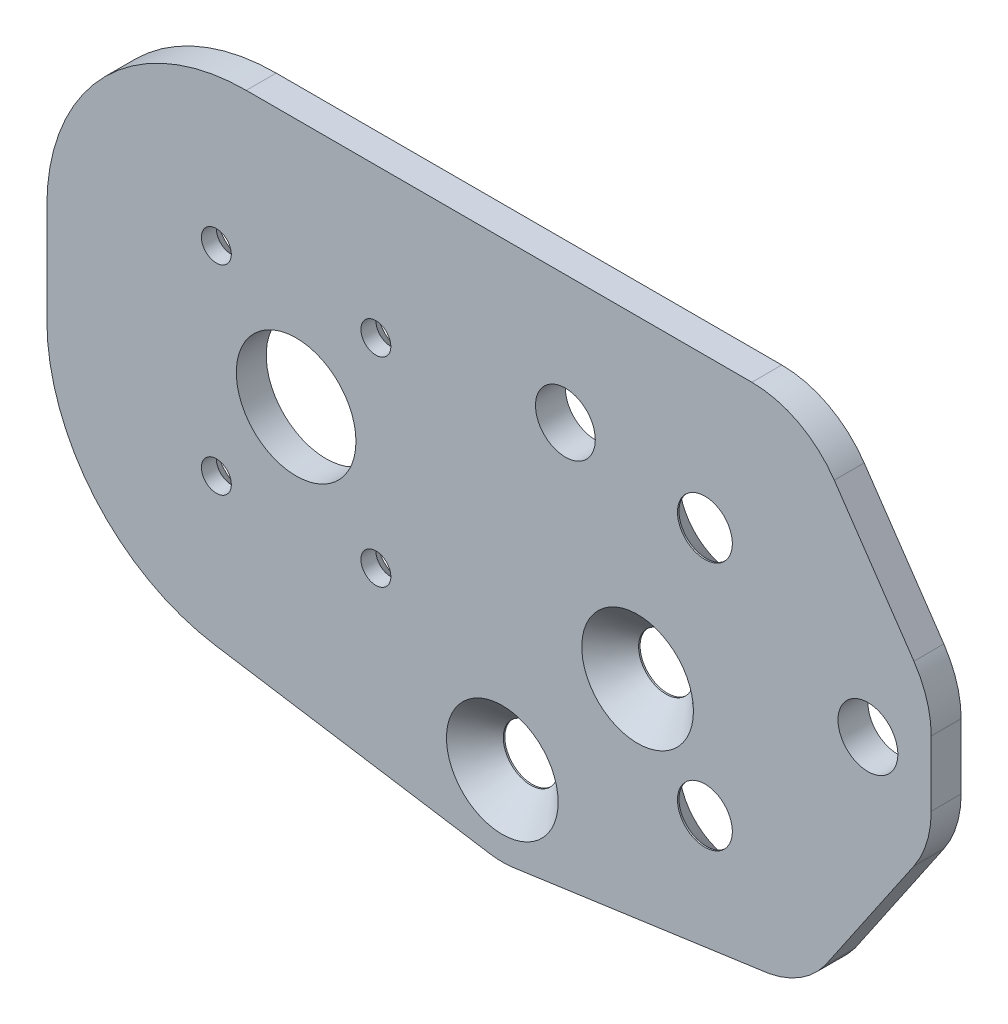
ISO-10303-21;
HEADER;
FILE_DESCRIPTION(('STEP AP214'),'2;1');
FILE_NAME('part.step','',(''),(''),'','','');
FILE_SCHEMA(('AUTOMOTIVE_DESIGN { 1 0 10303 214 1 1 1 1 }'));
ENDSEC;
DATA;
#1=APPLICATION_CONTEXT('core data for automotive mechanical design processes');
#2=APPLICATION_PROTOCOL_DEFINITION('international standard','automotive_design',2000,#1);
#3=PRODUCT_CONTEXT('',#1,'mechanical');
#4=PRODUCT('Part','Part','',(#3));
#5=PRODUCT_RELATED_PRODUCT_CATEGORY('part','',(#4));
#6=PRODUCT_DEFINITION_FORMATION('','',#4);
#7=PRODUCT_DEFINITION_CONTEXT('part definition',#1,'design');
#8=PRODUCT_DEFINITION('design','',#6,#7);
#9=PRODUCT_DEFINITION_SHAPE('','',#8);
#10=(LENGTH_UNIT() NAMED_UNIT(*) SI_UNIT(.MILLI.,.METRE.));
#11=(NAMED_UNIT(*) PLANE_ANGLE_UNIT() SI_UNIT($,.RADIAN.));
#12=(NAMED_UNIT(*) SI_UNIT($,.STERADIAN.) SOLID_ANGLE_UNIT());
#13=UNCERTAINTY_MEASURE_WITH_UNIT(LENGTH_MEASURE(1.E-05),#10,'distance_accuracy_value','');
#14=(GEOMETRIC_REPRESENTATION_CONTEXT(3) GLOBAL_UNCERTAINTY_ASSIGNED_CONTEXT((#13)) GLOBAL_UNIT_ASSIGNED_CONTEXT((#10,
#11,#12)) REPRESENTATION_CONTEXT('',''));
#15=CARTESIAN_POINT('',(0.,0.,0.));
#16=DIRECTION('',(0.,0.,1.));
#17=DIRECTION('',(1.,0.,0.));
#18=AXIS2_PLACEMENT_3D('',#15,#16,#17);
#19=CARTESIAN_POINT('',(0.,0.,3.));
#20=DIRECTION('',(0.,0.,-1.));
#21=DIRECTION('',(-1.,0.,0.));
#22=AXIS2_PLACEMENT_3D('',#19,#20,#21);
#23=PLANE('',#22);
#24=CARTESIAN_POINT('',(66.,35.,3.));
#25=DIRECTION('',(0.,0.,-1.));
#26=DIRECTION('',(-1.,0.,0.));
#27=AXIS2_PLACEMENT_3D('',#24,#25,#26);
#28=CIRCLE('',#27,2.74999999999999);
#29=CARTESIAN_POINT('',(63.25,35.,3.));
#30=VERTEX_POINT('',#29);
#31=EDGE_CURVE('E399',#30,#30,#28,.T.);
#32=ORIENTED_EDGE('',*,*,#31,.T.);
#33=EDGE_LOOP('',(#32));
#34=FACE_BOUND('',#33,.T.);
#35=CARTESIAN_POINT('',(66.,10.,3.));
#36=DIRECTION('',(0.,0.,-1.));
#37=DIRECTION('',(-1.,0.,0.));
#38=AXIS2_PLACEMENT_3D('',#35,#36,#37);
#39=CIRCLE('',#38,2.74999999999999);
#40=CARTESIAN_POINT('',(63.25,10.,3.));
#41=VERTEX_POINT('',#40);
#42=EDGE_CURVE('E390',#41,#41,#39,.T.);
#43=ORIENTED_EDGE('',*,*,#42,.T.);
#44=EDGE_LOOP('',(#43));
#45=FACE_BOUND('',#44,.T.);
#46=CARTESIAN_POINT('',(59.25,18.5,3.));
#47=DIRECTION('',(0.,0.,1.));
#48=DIRECTION('',(1.,0.,0.));
#49=AXIS2_PLACEMENT_3D('',#46,#47,#48);
#50=CIRCLE('',#49,5.6);
#51=CARTESIAN_POINT('',(64.85,18.5,3.));
#52=VERTEX_POINT('',#51);
#53=EDGE_CURVE('E387',#52,#52,#50,.T.);
#54=ORIENTED_EDGE('',*,*,#53,.F.);
#55=EDGE_LOOP('',(#54));
#56=FACE_BOUND('',#55,.T.);
#57=CARTESIAN_POINT('',(45.6807315621671,3.80731630837885,3.));
#58=DIRECTION('',(0.,0.,1.));
#59=DIRECTION('',(1.,0.,0.));
#60=AXIS2_PLACEMENT_3D('',#57,#58,#59);
#61=CIRCLE('',#60,5.6);
#62=CARTESIAN_POINT('',(51.2807315621671,3.80731630837885,3.));
#63=VERTEX_POINT('',#62);
#64=EDGE_CURVE('E378',#63,#63,#61,.T.);
#65=ORIENTED_EDGE('',*,*,#64,.F.);
#66=EDGE_LOOP('',(#65));
#67=FACE_BOUND('',#66,.T.);
#68=CARTESIAN_POINT('',(70.7403470261077,8.44715504380979,3.));
#69=DIRECTION('',(0.,0.,-1.));
#70=DIRECTION('',(-1.,0.,0.));
#71=AXIS2_PLACEMENT_3D('',#68,#69,#70);
#72=CIRCLE('',#71,9.10908448907365);
#73=CARTESIAN_POINT('',(78.0602989436961,3.02555711024113,3.));
#74=VERTEX_POINT('',#73);
#75=CARTESIAN_POINT('',(72.4471663459443,-0.500592607890878,3.));
#76=VERTEX_POINT('',#75);
#77=EDGE_CURVE('E144',#74,#76,#72,.T.);
#78=ORIENTED_EDGE('',*,*,#77,.F.);
#79=DIRECTION('',(-0.562855404948442,-0.826555378132842,0.));
#80=VECTOR('',#79,1.);
#81=CARTESIAN_POINT('',(51.9227282771398,-35.3575683174134,3.));
#82=LINE('',#81,#80);
#83=CARTESIAN_POINT('',(86.9655537813216,16.1029588993509,3.));
#84=VERTEX_POINT('',#83);
#85=EDGE_CURVE('E159',#84,#74,#82,.T.);
#86=ORIENTED_EDGE('',*,*,#85,.F.);
#87=CARTESIAN_POINT('',(78.6999999999932,21.7315129488353,3.));
#88=DIRECTION('',(0.,0.,-1.));
#89=DIRECTION('',(-1.,0.,0.));
#90=AXIS2_PLACEMENT_3D('',#87,#88,#89);
#91=CIRCLE('',#90,9.99999999999999);
#92=CARTESIAN_POINT('',(88.6999999999931,21.7315129488347,3.));
#93=VERTEX_POINT('',#92);
#94=EDGE_CURVE('E153',#93,#84,#91,.T.);
#95=ORIENTED_EDGE('',*,*,#94,.F.);
#96=DIRECTION('',(0.,-1.,0.));
#97=VECTOR('',#96,1.);
#98=CARTESIAN_POINT('',(88.6999999999919,-5.27260369399634E-12,3.));
#99=LINE('',#98,#97);
#100=CARTESIAN_POINT('',(88.6999999999935,28.2684870511611,3.));
#101=VERTEX_POINT('',#100);
#102=EDGE_CURVE('E183',#101,#93,#99,.T.);
#103=ORIENTED_EDGE('',*,*,#102,.F.);
#104=CARTESIAN_POINT('',(78.6999999999935,28.2684870511617,3.));
#105=DIRECTION('',(0.,0.,-1.));
#106=DIRECTION('',(-1.,0.,0.));
#107=AXIS2_PLACEMENT_3D('',#104,#105,#106);
#108=CIRCLE('',#107,10.);
#109=CARTESIAN_POINT('',(86.9655537813226,33.8970411006451,3.));
#110=VERTEX_POINT('',#109);
#111=EDGE_CURVE('E180',#110,#101,#108,.T.);
#112=ORIENTED_EDGE('',*,*,#111,.F.);
#113=DIRECTION('',(0.562855404948344,-0.826555378132909,0.));
#114=VECTOR('',#113,1.);
#115=CARTESIAN_POINT('',(75.1842863807105,51.1978786613888,3.));
#116=LINE('',#115,#114);
#117=CARTESIAN_POINT('',(78.9768023362709,45.6285540494824,3.));
#118=VERTEX_POINT('',#117);
#119=EDGE_CURVE('E171',#118,#110,#116,.T.);
#120=ORIENTED_EDGE('',*,*,#119,.F.);
#121=CARTESIAN_POINT('',(70.7112485549419,39.999999999999,3.));
#122=DIRECTION('',(0.,0.,-1.));
#123=DIRECTION('',(-1.,0.,0.));
#124=AXIS2_PLACEMENT_3D('',#121,#122,#123);
#125=CIRCLE('',#124,10.);
#126=CARTESIAN_POINT('',(70.7112485549419,50.,3.));
#127=VERTEX_POINT('',#126);
#128=EDGE_CURVE('E167',#127,#118,#125,.T.);
#129=ORIENTED_EDGE('',*,*,#128,.F.);
#130=DIRECTION('',(-1.,0.,0.));
#131=VECTOR('',#130,1.);
#132=CARTESIAN_POINT('',(0.,50.,3.));
#133=LINE('',#132,#131);
#134=CARTESIAN_POINT('',(20.,50.,3.));
#135=VERTEX_POINT('',#134);
#136=EDGE_CURVE('E63',#127,#135,#133,.T.);
#137=ORIENTED_EDGE('',*,*,#136,.T.);
#138=CARTESIAN_POINT('',(20.,30.,3.));
#139=DIRECTION('',(0.,0.,-1.));
#140=DIRECTION('',(-1.,0.,0.));
#141=AXIS2_PLACEMENT_3D('',#138,#139,#140);
#142=CIRCLE('',#141,20.);
#143=CARTESIAN_POINT('',(0.,30.,3.));
#144=VERTEX_POINT('',#143);
#145=EDGE_CURVE('E275',#135,#144,#142,.F.);
#146=ORIENTED_EDGE('',*,*,#145,.T.);
#147=DIRECTION('',(0.,-1.,0.));
#148=VECTOR('',#147,1.);
#149=CARTESIAN_POINT('',(0.,0.,3.));
#150=LINE('',#149,#148);
#151=CARTESIAN_POINT('',(0.,20.,3.));
#152=VERTEX_POINT('',#151);
#153=EDGE_CURVE('E257',#144,#152,#150,.T.);
#154=ORIENTED_EDGE('',*,*,#153,.T.);
#155=CARTESIAN_POINT('',(20.,20.,3.));
#156=DIRECTION('',(0.,0.,-1.));
#157=DIRECTION('',(-1.,0.,0.));
#158=AXIS2_PLACEMENT_3D('',#155,#156,#157);
#159=CIRCLE('',#158,20.);
#160=CARTESIAN_POINT('',(16.888140703302,0.243574925671539,3.));
#161=VERTEX_POINT('',#160);
#162=EDGE_CURVE('E277',#152,#161,#159,.F.);
#163=ORIENTED_EDGE('',*,*,#162,.T.);
#164=DIRECTION('',(-0.987821253716423,0.155592964834902,0.));
#165=VECTOR('',#164,1.);
#166=CARTESIAN_POINT('',(0.446284869277622,2.8333522634026,3.));
#167=LINE('',#166,#165);
#168=CARTESIAN_POINT('',(44.4359467579836,-4.0955145630582,3.));
#169=VERTEX_POINT('',#168);
#170=EDGE_CURVE('E219',#169,#161,#167,.T.);
#171=ORIENTED_EDGE('',*,*,#170,.F.);
#172=CARTESIAN_POINT('',(45.6807315621671,3.80731630837885,3.));
#173=DIRECTION('',(0.,0.,-1.));
#174=DIRECTION('',(-1.,0.,0.));
#175=AXIS2_PLACEMENT_3D('',#172,#173,#174);
#176=CIRCLE('',#175,8.00026405759614);
#177=CARTESIAN_POINT('',(46.7969396353484,-4.11469761035605,3.));
#178=VERTEX_POINT('',#177);
#179=EDGE_CURVE('E216',#178,#169,#176,.T.);
#180=ORIENTED_EDGE('',*,*,#179,.F.);
#181=DIRECTION('',(-0.990219055483932,-0.13952140393685,0.));
#182=VECTOR('',#181,1.);
#183=CARTESIAN_POINT('',(1.47943288389472,-10.4999132147866,3.));
#184=LINE('',#183,#182);
#185=EDGE_CURVE('E162',#76,#178,#184,.T.);
#186=ORIENTED_EDGE('',*,*,#185,.F.);
#187=EDGE_LOOP('',(#78,#86,#95,#103,#112,#120,#129,#137,#146,#154,#163,#171,#180,#186));
#188=FACE_BOUND('',#187,.T.);
#189=CARTESIAN_POINT('',(52.0071048996352,37.1424373558049,3.));
#190=DIRECTION('',(0.,0.,1.));
#191=DIRECTION('',(1.,0.,0.));
#192=AXIS2_PLACEMENT_3D('',#189,#190,#191);
#193=CIRCLE('',#192,3.);
#194=CARTESIAN_POINT('',(55.0071048996352,37.1424373558049,3.));
#195=VERTEX_POINT('',#194);
#196=EDGE_CURVE('E228',#195,#195,#193,.T.);
#197=ORIENTED_EDGE('',*,*,#196,.F.);
#198=EDGE_LOOP('',(#197));
#199=FACE_BOUND('',#198,.T.);
#200=CARTESIAN_POINT('',(17.,35.,3.));
#201=DIRECTION('',(0.,0.,1.));
#202=DIRECTION('',(1.,0.,0.));
#203=AXIS2_PLACEMENT_3D('',#200,#201,#202);
#204=CIRCLE('',#203,1.5);
#205=CARTESIAN_POINT('',(18.5,35.,3.));
#206=VERTEX_POINT('',#205);
#207=EDGE_CURVE('E236',#206,#206,#204,.T.);
#208=ORIENTED_EDGE('',*,*,#207,.F.);
#209=EDGE_LOOP('',(#208));
#210=FACE_BOUND('',#209,.T.);
#211=CARTESIAN_POINT('',(17.,15.,3.));
#212=DIRECTION('',(0.,0.,1.));
#213=DIRECTION('',(1.,0.,0.));
#214=AXIS2_PLACEMENT_3D('',#211,#212,#213);
#215=CIRCLE('',#214,1.5);
#216=CARTESIAN_POINT('',(18.5,15.,3.));
#217=VERTEX_POINT('',#216);
#218=EDGE_CURVE('E243',#217,#217,#215,.T.);
#219=ORIENTED_EDGE('',*,*,#218,.F.);
#220=EDGE_LOOP('',(#219));
#221=FACE_BOUND('',#220,.T.);
#222=CARTESIAN_POINT('',(33.,15.,3.));
#223=DIRECTION('',(0.,0.,1.));
#224=DIRECTION('',(1.,0.,0.));
#225=AXIS2_PLACEMENT_3D('',#222,#223,#224);
#226=CIRCLE('',#225,1.5);
#227=CARTESIAN_POINT('',(34.5,15.,3.));
#228=VERTEX_POINT('',#227);
#229=EDGE_CURVE('E239',#228,#228,#226,.T.);
#230=ORIENTED_EDGE('',*,*,#229,.F.);
#231=EDGE_LOOP('',(#230));
#232=FACE_BOUND('',#231,.T.);
#233=CARTESIAN_POINT('',(33.,35.,3.));
#234=DIRECTION('',(0.,0.,1.));
#235=DIRECTION('',(1.,0.,0.));
#236=AXIS2_PLACEMENT_3D('',#233,#234,#235);
#237=CIRCLE('',#236,1.5);
#238=CARTESIAN_POINT('',(34.5,35.,3.));
#239=VERTEX_POINT('',#238);
#240=EDGE_CURVE('E242',#239,#239,#237,.T.);
#241=ORIENTED_EDGE('',*,*,#240,.F.);
#242=EDGE_LOOP('',(#241));
#243=FACE_BOUND('',#242,.T.);
#244=CARTESIAN_POINT('',(25.,25.,3.));
#245=DIRECTION('',(0.,0.,1.));
#246=DIRECTION('',(1.,0.,0.));
#247=AXIS2_PLACEMENT_3D('',#244,#245,#246);
#248=CIRCLE('',#247,6.);
#249=CARTESIAN_POINT('',(31.,25.,3.));
#250=VERTEX_POINT('',#249);
#251=EDGE_CURVE('E251',#250,#250,#248,.T.);
#252=ORIENTED_EDGE('',*,*,#251,.F.);
#253=EDGE_LOOP('',(#252));
#254=FACE_BOUND('',#253,.T.);
#255=CARTESIAN_POINT('',(82.3499999999919,25.0000000000032,3.));
#256=DIRECTION('',(0.,0.,-1.));
#257=DIRECTION('',(-1.,0.,0.));
#258=AXIS2_PLACEMENT_3D('',#255,#256,#257);
#259=CIRCLE('',#258,3.00000000000001);
#260=CARTESIAN_POINT('',(79.3499999999919,25.0000000000032,3.));
#261=VERTEX_POINT('',#260);
#262=EDGE_CURVE('E168',#261,#261,#259,.T.);
#263=ORIENTED_EDGE('',*,*,#262,.T.);
#264=EDGE_LOOP('',(#263));
#265=FACE_BOUND('',#264,.T.);
#266=ADVANCED_FACE('F39',(#34,#45,#56,#67,#188,#199,#210,#221,#232,#243,#254,#265),#23,.F.);
#267=CARTESIAN_POINT('',(0.,0.,0.));
#268=DIRECTION('',(0.,0.,-1.));
#269=DIRECTION('',(-1.,0.,0.));
#270=AXIS2_PLACEMENT_3D('',#267,#268,#269);
#271=PLANE('',#270);
#272=CARTESIAN_POINT('',(66.,35.,0.));
#273=DIRECTION('',(0.,0.,-1.));
#274=DIRECTION('',(-1.,0.,0.));
#275=AXIS2_PLACEMENT_3D('',#272,#273,#274);
#276=CIRCLE('',#275,5.59999999999999);
#277=CARTESIAN_POINT('',(60.4,35.,0.));
#278=VERTEX_POINT('',#277);
#279=EDGE_CURVE('E405',#278,#278,#276,.T.);
#280=ORIENTED_EDGE('',*,*,#279,.F.);
#281=EDGE_LOOP('',(#280));
#282=FACE_BOUND('',#281,.T.);
#283=CARTESIAN_POINT('',(66.,10.,0.));
#284=DIRECTION('',(0.,0.,-1.));
#285=DIRECTION('',(-1.,0.,0.));
#286=AXIS2_PLACEMENT_3D('',#283,#284,#285);
#287=CIRCLE('',#286,5.59999999999999);
#288=CARTESIAN_POINT('',(60.4,10.,0.));
#289=VERTEX_POINT('',#288);
#290=EDGE_CURVE('E396',#289,#289,#287,.T.);
#291=ORIENTED_EDGE('',*,*,#290,.F.);
#292=EDGE_LOOP('',(#291));
#293=FACE_BOUND('',#292,.T.);
#294=CARTESIAN_POINT('',(59.25,18.5,0.));
#295=DIRECTION('',(0.,0.,1.));
#296=DIRECTION('',(1.,0.,0.));
#297=AXIS2_PLACEMENT_3D('',#294,#295,#296);
#298=CIRCLE('',#297,2.75);
#299=CARTESIAN_POINT('',(62.,18.5,0.));
#300=VERTEX_POINT('',#299);
#301=EDGE_CURVE('E381',#300,#300,#298,.T.);
#302=ORIENTED_EDGE('',*,*,#301,.T.);
#303=EDGE_LOOP('',(#302));
#304=FACE_BOUND('',#303,.T.);
#305=CARTESIAN_POINT('',(45.6807315621671,3.80731630837885,0.));
#306=DIRECTION('',(0.,0.,1.));
#307=DIRECTION('',(1.,0.,0.));
#308=AXIS2_PLACEMENT_3D('',#305,#306,#307);
#309=CIRCLE('',#308,2.75);
#310=CARTESIAN_POINT('',(48.430731562167,3.80731630837885,0.));
#311=VERTEX_POINT('',#310);
#312=EDGE_CURVE('E346',#311,#311,#309,.T.);
#313=ORIENTED_EDGE('',*,*,#312,.T.);
#314=EDGE_LOOP('',(#313));
#315=FACE_BOUND('',#314,.T.);
#316=CARTESIAN_POINT('',(17.,35.,0.));
#317=DIRECTION('',(0.,0.,-1.));
#318=DIRECTION('',(-1.,0.,0.));
#319=AXIS2_PLACEMENT_3D('',#316,#317,#318);
#320=CIRCLE('',#319,3.);
#321=CARTESIAN_POINT('',(14.,35.,0.));
#322=VERTEX_POINT('',#321);
#323=EDGE_CURVE('E291',#322,#322,#320,.F.);
#324=ORIENTED_EDGE('',*,*,#323,.T.);
#325=EDGE_LOOP('',(#324));
#326=FACE_BOUND('',#325,.T.);
#327=CARTESIAN_POINT('',(17.,15.,0.));
#328=DIRECTION('',(0.,0.,-1.));
#329=DIRECTION('',(-1.,0.,0.));
#330=AXIS2_PLACEMENT_3D('',#327,#328,#329);
#331=CIRCLE('',#330,3.);
#332=CARTESIAN_POINT('',(14.,15.,0.));
#333=VERTEX_POINT('',#332);
#334=EDGE_CURVE('E288',#333,#333,#331,.F.);
#335=ORIENTED_EDGE('',*,*,#334,.T.);
#336=EDGE_LOOP('',(#335));
#337=FACE_BOUND('',#336,.T.);
#338=CARTESIAN_POINT('',(33.,15.,0.));
#339=DIRECTION('',(0.,0.,-1.));
#340=DIRECTION('',(-1.,0.,0.));
#341=AXIS2_PLACEMENT_3D('',#338,#339,#340);
#342=CIRCLE('',#341,3.);
#343=CARTESIAN_POINT('',(30.,15.,0.));
#344=VERTEX_POINT('',#343);
#345=EDGE_CURVE('E285',#344,#344,#342,.F.);
#346=ORIENTED_EDGE('',*,*,#345,.T.);
#347=EDGE_LOOP('',(#346));
#348=FACE_BOUND('',#347,.T.);
#349=CARTESIAN_POINT('',(33.,35.,0.));
#350=DIRECTION('',(0.,0.,-1.));
#351=DIRECTION('',(-1.,0.,0.));
#352=AXIS2_PLACEMENT_3D('',#349,#350,#351);
#353=CIRCLE('',#352,3.);
#354=CARTESIAN_POINT('',(30.,35.,0.));
#355=VERTEX_POINT('',#354);
#356=EDGE_CURVE('E282',#355,#355,#353,.F.);
#357=ORIENTED_EDGE('',*,*,#356,.T.);
#358=EDGE_LOOP('',(#357));
#359=FACE_BOUND('',#358,.T.);
#360=CARTESIAN_POINT('',(82.3499999999919,25.0000000000032,0.));
#361=DIRECTION('',(0.,0.,-1.));
#362=DIRECTION('',(-1.,0.,0.));
#363=AXIS2_PLACEMENT_3D('',#360,#361,#362);
#364=CIRCLE('',#363,3.00000000000001);
#365=CARTESIAN_POINT('',(79.3499999999919,25.0000000000032,0.));
#366=VERTEX_POINT('',#365);
#367=EDGE_CURVE('E187',#366,#366,#364,.T.);
#368=ORIENTED_EDGE('',*,*,#367,.F.);
#369=EDGE_LOOP('',(#368));
#370=FACE_BOUND('',#369,.T.);
#371=CARTESIAN_POINT('',(25.,25.,0.));
#372=DIRECTION('',(0.,0.,1.));
#373=DIRECTION('',(1.,0.,0.));
#374=AXIS2_PLACEMENT_3D('',#371,#372,#373);
#375=CIRCLE('',#374,6.);
#376=CARTESIAN_POINT('',(31.,25.,0.));
#377=VERTEX_POINT('',#376);
#378=EDGE_CURVE('E250',#377,#377,#375,.T.);
#379=ORIENTED_EDGE('',*,*,#378,.T.);
#380=EDGE_LOOP('',(#379));
#381=FACE_BOUND('',#380,.T.);
#382=CARTESIAN_POINT('',(52.0071048996352,37.1424373558049,0.));
#383=DIRECTION('',(0.,0.,1.));
#384=DIRECTION('',(1.,0.,0.));
#385=AXIS2_PLACEMENT_3D('',#382,#383,#384);
#386=CIRCLE('',#385,3.);
#387=CARTESIAN_POINT('',(55.0071048996352,37.1424373558049,0.));
#388=VERTEX_POINT('',#387);
#389=EDGE_CURVE('E233',#388,#388,#386,.T.);
#390=ORIENTED_EDGE('',*,*,#389,.T.);
#391=EDGE_LOOP('',(#390));
#392=FACE_BOUND('',#391,.T.);
#393=DIRECTION('',(-0.562855404948442,-0.826555378132842,0.));
#394=VECTOR('',#393,1.);
#395=CARTESIAN_POINT('',(51.9227282771398,-35.3575683174134,0.));
#396=LINE('',#395,#394);
#397=CARTESIAN_POINT('',(86.9655537813216,16.1029588993509,0.));
#398=VERTEX_POINT('',#397);
#399=CARTESIAN_POINT('',(78.0602989436961,3.02555711024113,0.));
#400=VERTEX_POINT('',#399);
#401=EDGE_CURVE('E190',#398,#400,#396,.T.);
#402=ORIENTED_EDGE('',*,*,#401,.T.);
#403=CARTESIAN_POINT('',(70.7403470261077,8.44715504380979,0.));
#404=DIRECTION('',(0.,0.,-1.));
#405=DIRECTION('',(-1.,0.,0.));
#406=AXIS2_PLACEMENT_3D('',#403,#404,#405);
#407=CIRCLE('',#406,9.10908448907365);
#408=CARTESIAN_POINT('',(72.4471663459443,-0.500592607890878,0.));
#409=VERTEX_POINT('',#408);
#410=EDGE_CURVE('E147',#400,#409,#407,.T.);
#411=ORIENTED_EDGE('',*,*,#410,.T.);
#412=DIRECTION('',(-0.990219055483932,-0.13952140393685,0.));
#413=VECTOR('',#412,1.);
#414=CARTESIAN_POINT('',(1.47943288389472,-10.4999132147866,0.));
#415=LINE('',#414,#413);
#416=CARTESIAN_POINT('',(46.7969396353484,-4.11469761035605,0.));
#417=VERTEX_POINT('',#416);
#418=EDGE_CURVE('E207',#409,#417,#415,.T.);
#419=ORIENTED_EDGE('',*,*,#418,.T.);
#420=CARTESIAN_POINT('',(45.6807315621671,3.80731630837885,0.));
#421=DIRECTION('',(0.,0.,-1.));
#422=DIRECTION('',(-1.,0.,0.));
#423=AXIS2_PLACEMENT_3D('',#420,#421,#422);
#424=CIRCLE('',#423,8.00026405759614);
#425=CARTESIAN_POINT('',(44.4359467579836,-4.0955145630582,0.));
#426=VERTEX_POINT('',#425);
#427=EDGE_CURVE('E223',#417,#426,#424,.T.);
#428=ORIENTED_EDGE('',*,*,#427,.T.);
#429=DIRECTION('',(-0.987821253716423,0.155592964834902,0.));
#430=VECTOR('',#429,1.);
#431=CARTESIAN_POINT('',(0.446284869277622,2.8333522634026,0.));
#432=LINE('',#431,#430);
#433=CARTESIAN_POINT('',(16.888140703302,0.243574925671546,0.));
#434=VERTEX_POINT('',#433);
#435=EDGE_CURVE('E55',#426,#434,#432,.T.);
#436=ORIENTED_EDGE('',*,*,#435,.T.);
#437=CARTESIAN_POINT('',(20.,20.,0.));
#438=DIRECTION('',(0.,0.,-1.));
#439=DIRECTION('',(-1.,0.,0.));
#440=AXIS2_PLACEMENT_3D('',#437,#438,#439);
#441=CIRCLE('',#440,20.);
#442=CARTESIAN_POINT('',(0.,20.,0.));
#443=VERTEX_POINT('',#442);
#444=EDGE_CURVE('E268',#434,#443,#441,.T.);
#445=ORIENTED_EDGE('',*,*,#444,.T.);
#446=DIRECTION('',(0.,-1.,0.));
#447=VECTOR('',#446,1.);
#448=CARTESIAN_POINT('',(0.,0.,0.));
#449=LINE('',#448,#447);
#450=CARTESIAN_POINT('',(0.,30.,0.));
#451=VERTEX_POINT('',#450);
#452=EDGE_CURVE('E254',#451,#443,#449,.T.);
#453=ORIENTED_EDGE('',*,*,#452,.F.);
#454=CARTESIAN_POINT('',(20.,30.,0.));
#455=DIRECTION('',(0.,0.,-1.));
#456=DIRECTION('',(-1.,0.,0.));
#457=AXIS2_PLACEMENT_3D('',#454,#455,#456);
#458=CIRCLE('',#457,20.);
#459=CARTESIAN_POINT('',(20.,50.,0.));
#460=VERTEX_POINT('',#459);
#461=EDGE_CURVE('E262',#451,#460,#458,.T.);
#462=ORIENTED_EDGE('',*,*,#461,.T.);
#463=DIRECTION('',(-1.,0.,0.));
#464=VECTOR('',#463,1.);
#465=CARTESIAN_POINT('',(0.,50.,0.));
#466=LINE('',#465,#464);
#467=CARTESIAN_POINT('',(70.7112485549419,50.,0.));
#468=VERTEX_POINT('',#467);
#469=EDGE_CURVE('E260',#468,#460,#466,.T.);
#470=ORIENTED_EDGE('',*,*,#469,.F.);
#471=CARTESIAN_POINT('',(70.7112485549419,39.999999999999,0.));
#472=DIRECTION('',(0.,0.,-1.));
#473=DIRECTION('',(-1.,0.,0.));
#474=AXIS2_PLACEMENT_3D('',#471,#472,#473);
#475=CIRCLE('',#474,10.);
#476=CARTESIAN_POINT('',(78.9768023362709,45.6285540494824,0.));
#477=VERTEX_POINT('',#476);
#478=EDGE_CURVE('E192',#468,#477,#475,.T.);
#479=ORIENTED_EDGE('',*,*,#478,.T.);
#480=DIRECTION('',(0.562855404948344,-0.826555378132909,0.));
#481=VECTOR('',#480,1.);
#482=CARTESIAN_POINT('',(75.1842863807105,51.1978786613888,0.));
#483=LINE('',#482,#481);
#484=CARTESIAN_POINT('',(86.9655537813226,33.8970411006451,0.));
#485=VERTEX_POINT('',#484);
#486=EDGE_CURVE('E195',#477,#485,#483,.T.);
#487=ORIENTED_EDGE('',*,*,#486,.T.);
#488=CARTESIAN_POINT('',(78.6999999999935,28.2684870511617,0.));
#489=DIRECTION('',(0.,0.,-1.));
#490=DIRECTION('',(-1.,0.,0.));
#491=AXIS2_PLACEMENT_3D('',#488,#489,#490);
#492=CIRCLE('',#491,10.);
#493=CARTESIAN_POINT('',(88.6999999999935,28.2684870511611,0.));
#494=VERTEX_POINT('',#493);
#495=EDGE_CURVE('E198',#485,#494,#492,.T.);
#496=ORIENTED_EDGE('',*,*,#495,.T.);
#497=DIRECTION('',(0.,-1.,0.));
#498=VECTOR('',#497,1.);
#499=CARTESIAN_POINT('',(88.6999999999919,-5.27260369399634E-12,0.));
#500=LINE('',#499,#498);
#501=CARTESIAN_POINT('',(88.6999999999931,21.7315129488347,0.));
#502=VERTEX_POINT('',#501);
#503=EDGE_CURVE('E201',#494,#502,#500,.T.);
#504=ORIENTED_EDGE('',*,*,#503,.T.);
#505=CARTESIAN_POINT('',(78.6999999999932,21.7315129488353,0.));
#506=DIRECTION('',(0.,0.,-1.));
#507=DIRECTION('',(-1.,0.,0.));
#508=AXIS2_PLACEMENT_3D('',#505,#506,#507);
#509=CIRCLE('',#508,9.99999999999999);
#510=EDGE_CURVE('E174',#502,#398,#509,.T.);
#511=ORIENTED_EDGE('',*,*,#510,.T.);
#512=EDGE_LOOP('',(#402,#411,#419,#428,#436,#445,#453,#462,#470,#479,#487,#496,#504,#511));
#513=FACE_BOUND('',#512,.T.);
#514=ADVANCED_FACE('F311',(#282,#293,#304,#315,#326,#337,#348,#359,#370,#381,#392,#513),#271,.T.);
#515=CARTESIAN_POINT('',(0.,50.,3.));
#516=DIRECTION('',(0.,-1.,0.));
#517=DIRECTION('',(0.,0.,-1.));
#518=AXIS2_PLACEMENT_3D('',#515,#516,#517);
#519=PLANE('',#518);
#520=DIRECTION('',(0.,0.,-1.));
#521=VECTOR('',#520,1.);
#522=CARTESIAN_POINT('',(70.7112485549419,50.,3.));
#523=LINE('',#522,#521);
#524=EDGE_CURVE('E343',#127,#468,#523,.T.);
#525=ORIENTED_EDGE('',*,*,#524,.T.);
#526=ORIENTED_EDGE('',*,*,#469,.T.);
#527=DIRECTION('',(0.,0.,-1.));
#528=VECTOR('',#527,1.);
#529=CARTESIAN_POINT('',(20.,50.,3.));
#530=LINE('',#529,#528);
#531=EDGE_CURVE('E280',#460,#135,#530,.F.);
#532=ORIENTED_EDGE('',*,*,#531,.T.);
#533=ORIENTED_EDGE('',*,*,#136,.F.);
#534=EDGE_LOOP('',(#525,#526,#532,#533));
#535=FACE_BOUND('',#534,.T.);
#536=ADVANCED_FACE('F314',(#535),#519,.F.);
#537=CARTESIAN_POINT('',(1.47943288389472,-10.4999132147866,3.));
#538=DIRECTION('',(0.139521403936849,-0.990219055483932,0.));
#539=DIRECTION('',(0.990219055483932,0.13952140393685,0.));
#540=AXIS2_PLACEMENT_3D('',#537,#538,#539);
#541=PLANE('',#540);
#542=ORIENTED_EDGE('',*,*,#418,.F.);
#543=DIRECTION('',(0.,0.,-1.));
#544=VECTOR('',#543,1.);
#545=CARTESIAN_POINT('',(72.4471663459443,-0.500592607890878,3.));
#546=LINE('',#545,#544);
#547=EDGE_CURVE('E163',#76,#409,#546,.T.);
#548=ORIENTED_EDGE('',*,*,#547,.F.);
#549=ORIENTED_EDGE('',*,*,#185,.T.);
#550=DIRECTION('',(0.,0.,-1.));
#551=VECTOR('',#550,1.);
#552=CARTESIAN_POINT('',(46.7969396353484,-4.11469761035605,3.));
#553=LINE('',#552,#551);
#554=EDGE_CURVE('E221',#178,#417,#553,.T.);
#555=ORIENTED_EDGE('',*,*,#554,.T.);
#556=EDGE_LOOP('',(#542,#548,#549,#555));
#557=FACE_BOUND('',#556,.T.);
#558=ADVANCED_FACE('F369',(#557),#541,.T.);
#559=CARTESIAN_POINT('',(20.,20.,3.));
#560=DIRECTION('',(0.,0.,-1.));
#561=DIRECTION('',(-1.,0.,0.));
#562=AXIS2_PLACEMENT_3D('',#559,#560,#561);
#563=CYLINDRICAL_SURFACE('',#562,20.);
#564=ORIENTED_EDGE('',*,*,#444,.F.);
#565=DIRECTION('',(0.,0.,-1.));
#566=VECTOR('',#565,1.);
#567=CARTESIAN_POINT('',(16.888140703302,0.243574925671539,3.));
#568=LINE('',#567,#566);
#569=EDGE_CURVE('E226',#161,#434,#568,.T.);
#570=ORIENTED_EDGE('',*,*,#569,.F.);
#571=ORIENTED_EDGE('',*,*,#162,.F.);
#572=DIRECTION('',(0.,0.,-1.));
#573=VECTOR('',#572,1.);
#574=CARTESIAN_POINT('',(0.,20.,3.));
#575=LINE('',#574,#573);
#576=EDGE_CURVE('E273',#443,#152,#575,.F.);
#577=ORIENTED_EDGE('',*,*,#576,.F.);
#578=EDGE_LOOP('',(#564,#570,#571,#577));
#579=FACE_BOUND('',#578,.T.);
#580=ADVANCED_FACE('F360',(#579),#563,.T.);
#581=CARTESIAN_POINT('',(0.,0.,3.));
#582=DIRECTION('',(1.,0.,0.));
#583=DIRECTION('',(0.,0.,-1.));
#584=AXIS2_PLACEMENT_3D('',#581,#582,#583);
#585=PLANE('',#584);
#586=ORIENTED_EDGE('',*,*,#452,.T.);
#587=ORIENTED_EDGE('',*,*,#576,.T.);
#588=ORIENTED_EDGE('',*,*,#153,.F.);
#589=DIRECTION('',(0.,0.,-1.));
#590=VECTOR('',#589,1.);
#591=CARTESIAN_POINT('',(0.,30.,3.));
#592=LINE('',#591,#590);
#593=EDGE_CURVE('E270',#144,#451,#592,.T.);
#594=ORIENTED_EDGE('',*,*,#593,.T.);
#595=EDGE_LOOP('',(#586,#587,#588,#594));
#596=FACE_BOUND('',#595,.T.);
#597=ADVANCED_FACE('F355',(#596),#585,.F.);
#598=CARTESIAN_POINT('',(25.,25.,3.));
#599=DIRECTION('',(0.,0.,-1.));
#600=DIRECTION('',(-1.,0.,0.));
#601=AXIS2_PLACEMENT_3D('',#598,#599,#600);
#602=CYLINDRICAL_SURFACE('',#601,6.);
#603=ORIENTED_EDGE('',*,*,#251,.T.);
#604=EDGE_LOOP('',(#603));
#605=FACE_BOUND('',#604,.T.);
#606=ORIENTED_EDGE('',*,*,#378,.F.);
#607=EDGE_LOOP('',(#606));
#608=FACE_BOUND('',#607,.T.);
#609=ADVANCED_FACE('F439',(#605,#608),#602,.F.);
#610=CARTESIAN_POINT('',(20.,30.,3.));
#611=DIRECTION('',(0.,0.,-1.));
#612=DIRECTION('',(-1.,0.,0.));
#613=AXIS2_PLACEMENT_3D('',#610,#611,#612);
#614=CYLINDRICAL_SURFACE('',#613,20.);
#615=ORIENTED_EDGE('',*,*,#145,.F.);
#616=ORIENTED_EDGE('',*,*,#531,.F.);
#617=ORIENTED_EDGE('',*,*,#461,.F.);
#618=ORIENTED_EDGE('',*,*,#593,.F.);
#619=EDGE_LOOP('',(#615,#616,#617,#618));
#620=FACE_BOUND('',#619,.T.);
#621=ADVANCED_FACE('F351',(#620),#614,.T.);
#622=CARTESIAN_POINT('',(33.,35.,0.));
#623=DIRECTION('',(0.,0.,1.));
#624=DIRECTION('',(1.,0.,0.));
#625=AXIS2_PLACEMENT_3D('',#622,#623,#624);
#626=CYLINDRICAL_SURFACE('',#625,1.5);
#627=CARTESIAN_POINT('',(33.,35.,1.5));
#628=DIRECTION('',(0.,0.,-1.));
#629=DIRECTION('',(-1.,0.,0.));
#630=AXIS2_PLACEMENT_3D('',#627,#628,#629);
#631=CIRCLE('',#630,1.5);
#632=CARTESIAN_POINT('',(31.5,35.,1.5));
#633=VERTEX_POINT('',#632);
#634=EDGE_CURVE('E11',#633,#633,#631,.T.);
#635=ORIENTED_EDGE('',*,*,#634,.T.);
#636=EDGE_LOOP('',(#635));
#637=FACE_BOUND('',#636,.T.);
#638=ORIENTED_EDGE('',*,*,#240,.T.);
#639=EDGE_LOOP('',(#638));
#640=FACE_BOUND('',#639,.T.);
#641=ADVANCED_FACE('F449',(#637,#640),#626,.F.);
#642=CARTESIAN_POINT('',(33.,15.,0.));
#643=DIRECTION('',(0.,0.,1.));
#644=DIRECTION('',(1.,0.,0.));
#645=AXIS2_PLACEMENT_3D('',#642,#643,#644);
#646=CYLINDRICAL_SURFACE('',#645,1.5);
#647=CARTESIAN_POINT('',(33.,15.,1.5));
#648=DIRECTION('',(0.,0.,-1.));
#649=DIRECTION('',(-1.,0.,0.));
#650=AXIS2_PLACEMENT_3D('',#647,#648,#649);
#651=CIRCLE('',#650,1.5);
#652=CARTESIAN_POINT('',(31.5,15.,1.5));
#653=VERTEX_POINT('',#652);
#654=EDGE_CURVE('E48',#653,#653,#651,.T.);
#655=ORIENTED_EDGE('',*,*,#654,.T.);
#656=EDGE_LOOP('',(#655));
#657=FACE_BOUND('',#656,.T.);
#658=ORIENTED_EDGE('',*,*,#229,.T.);
#659=EDGE_LOOP('',(#658));
#660=FACE_BOUND('',#659,.T.);
#661=ADVANCED_FACE('F302',(#657,#660),#646,.F.);
#662=CARTESIAN_POINT('',(17.,15.,0.));
#663=DIRECTION('',(0.,0.,1.));
#664=DIRECTION('',(1.,0.,0.));
#665=AXIS2_PLACEMENT_3D('',#662,#663,#664);
#666=CYLINDRICAL_SURFACE('',#665,1.5);
#667=CARTESIAN_POINT('',(17.,15.,1.50000000000001));
#668=DIRECTION('',(0.,0.,-1.));
#669=DIRECTION('',(-1.,0.,0.));
#670=AXIS2_PLACEMENT_3D('',#667,#668,#669);
#671=CIRCLE('',#670,1.5);
#672=CARTESIAN_POINT('',(15.5,15.,1.50000000000001));
#673=VERTEX_POINT('',#672);
#674=EDGE_CURVE('E297',#673,#673,#671,.T.);
#675=ORIENTED_EDGE('',*,*,#674,.T.);
#676=EDGE_LOOP('',(#675));
#677=FACE_BOUND('',#676,.T.);
#678=ORIENTED_EDGE('',*,*,#218,.T.);
#679=EDGE_LOOP('',(#678));
#680=FACE_BOUND('',#679,.T.);
#681=ADVANCED_FACE('F500',(#677,#680),#666,.F.);
#682=CARTESIAN_POINT('',(17.,35.,0.));
#683=DIRECTION('',(0.,0.,1.));
#684=DIRECTION('',(1.,0.,0.));
#685=AXIS2_PLACEMENT_3D('',#682,#683,#684);
#686=CYLINDRICAL_SURFACE('',#685,1.5);
#687=CARTESIAN_POINT('',(17.,35.,1.50000000000001));
#688=DIRECTION('',(0.,0.,-1.));
#689=DIRECTION('',(-1.,0.,0.));
#690=AXIS2_PLACEMENT_3D('',#687,#688,#689);
#691=CIRCLE('',#690,1.5);
#692=CARTESIAN_POINT('',(15.5,35.,1.50000000000001));
#693=VERTEX_POINT('',#692);
#694=EDGE_CURVE('E294',#693,#693,#691,.T.);
#695=ORIENTED_EDGE('',*,*,#694,.T.);
#696=EDGE_LOOP('',(#695));
#697=FACE_BOUND('',#696,.T.);
#698=ORIENTED_EDGE('',*,*,#207,.T.);
#699=EDGE_LOOP('',(#698));
#700=FACE_BOUND('',#699,.T.);
#701=ADVANCED_FACE('F496',(#697,#700),#686,.F.);
#702=CARTESIAN_POINT('',(52.0071048996352,37.1424373558049,0.));
#703=DIRECTION('',(0.,0.,1.));
#704=DIRECTION('',(1.,0.,0.));
#705=AXIS2_PLACEMENT_3D('',#702,#703,#704);
#706=CYLINDRICAL_SURFACE('',#705,3.);
#707=ORIENTED_EDGE('',*,*,#389,.F.);
#708=EDGE_LOOP('',(#707));
#709=FACE_BOUND('',#708,.T.);
#710=ORIENTED_EDGE('',*,*,#196,.T.);
#711=EDGE_LOOP('',(#710));
#712=FACE_BOUND('',#711,.T.);
#713=ADVANCED_FACE('F489',(#709,#712),#706,.F.);
#714=CARTESIAN_POINT('',(0.446284869277622,2.8333522634026,3.));
#715=DIRECTION('',(-0.155592964834902,-0.987821253716423,0.));
#716=DIRECTION('',(0.987821253716423,-0.155592964834902,0.));
#717=AXIS2_PLACEMENT_3D('',#714,#715,#716);
#718=PLANE('',#717);
#719=ORIENTED_EDGE('',*,*,#435,.F.);
#720=DIRECTION('',(0.,0.,-1.));
#721=VECTOR('',#720,1.);
#722=CARTESIAN_POINT('',(44.4359467579836,-4.0955145630582,3.));
#723=LINE('',#722,#721);
#724=EDGE_CURVE('E229',#169,#426,#723,.T.);
#725=ORIENTED_EDGE('',*,*,#724,.F.);
#726=ORIENTED_EDGE('',*,*,#170,.T.);
#727=ORIENTED_EDGE('',*,*,#569,.T.);
#728=EDGE_LOOP('',(#719,#725,#726,#727));
#729=FACE_BOUND('',#728,.T.);
#730=ADVANCED_FACE('F486',(#729),#718,.T.);
#731=CARTESIAN_POINT('',(45.6807315621671,3.80731630837885,3.));
#732=DIRECTION('',(0.,0.,-1.));
#733=DIRECTION('',(-1.,0.,0.));
#734=AXIS2_PLACEMENT_3D('',#731,#732,#733);
#735=CYLINDRICAL_SURFACE('',#734,8.00026405759614);
#736=ORIENTED_EDGE('',*,*,#427,.F.);
#737=ORIENTED_EDGE('',*,*,#554,.F.);
#738=ORIENTED_EDGE('',*,*,#179,.T.);
#739=ORIENTED_EDGE('',*,*,#724,.T.);
#740=EDGE_LOOP('',(#736,#737,#738,#739));
#741=FACE_BOUND('',#740,.T.);
#742=ADVANCED_FACE('F367',(#741),#735,.T.);
#743=CARTESIAN_POINT('',(51.9227282771398,-35.3575683174134,3.));
#744=DIRECTION('',(0.826555378132842,-0.562855404948442,0.));
#745=DIRECTION('',(0.562855404948442,0.826555378132842,0.));
#746=AXIS2_PLACEMENT_3D('',#743,#744,#745);
#747=PLANE('',#746);
#748=ORIENTED_EDGE('',*,*,#401,.F.);
#749=DIRECTION('',(0.,0.,-1.));
#750=VECTOR('',#749,1.);
#751=CARTESIAN_POINT('',(86.9655537813216,16.1029588993509,3.));
#752=LINE('',#751,#750);
#753=EDGE_CURVE('E166',#84,#398,#752,.T.);
#754=ORIENTED_EDGE('',*,*,#753,.F.);
#755=ORIENTED_EDGE('',*,*,#85,.T.);
#756=DIRECTION('',(0.,0.,-1.));
#757=VECTOR('',#756,1.);
#758=CARTESIAN_POINT('',(78.0602989436961,3.02555711024113,3.));
#759=LINE('',#758,#757);
#760=EDGE_CURVE('E141',#74,#400,#759,.T.);
#761=ORIENTED_EDGE('',*,*,#760,.T.);
#762=EDGE_LOOP('',(#748,#754,#755,#761));
#763=FACE_BOUND('',#762,.T.);
#764=ADVANCED_FACE('F165',(#763),#747,.T.);
#765=CARTESIAN_POINT('',(78.6999999999932,21.7315129488353,3.));
#766=DIRECTION('',(0.,0.,-1.));
#767=DIRECTION('',(-1.,0.,0.));
#768=AXIS2_PLACEMENT_3D('',#765,#766,#767);
#769=CYLINDRICAL_SURFACE('',#768,9.99999999999999);
#770=ORIENTED_EDGE('',*,*,#510,.F.);
#771=DIRECTION('',(0.,0.,-1.));
#772=VECTOR('',#771,1.);
#773=CARTESIAN_POINT('',(88.6999999999931,21.7315129488347,3.));
#774=LINE('',#773,#772);
#775=EDGE_CURVE('E208',#93,#502,#774,.T.);
#776=ORIENTED_EDGE('',*,*,#775,.F.);
#777=ORIENTED_EDGE('',*,*,#94,.T.);
#778=ORIENTED_EDGE('',*,*,#753,.T.);
#779=EDGE_LOOP('',(#770,#776,#777,#778));
#780=FACE_BOUND('',#779,.T.);
#781=ADVANCED_FACE('F328',(#780),#769,.T.);
#782=CARTESIAN_POINT('',(88.6999999999919,-5.27260369399634E-12,3.));
#783=DIRECTION('',(1.,0.,0.));
#784=DIRECTION('',(0.,1.,0.));
#785=AXIS2_PLACEMENT_3D('',#782,#783,#784);
#786=PLANE('',#785);
#787=ORIENTED_EDGE('',*,*,#503,.F.);
#788=DIRECTION('',(0.,0.,-1.));
#789=VECTOR('',#788,1.);
#790=CARTESIAN_POINT('',(88.6999999999935,28.2684870511611,3.));
#791=LINE('',#790,#789);
#792=EDGE_CURVE('E210',#101,#494,#791,.T.);
#793=ORIENTED_EDGE('',*,*,#792,.F.);
#794=ORIENTED_EDGE('',*,*,#102,.T.);
#795=ORIENTED_EDGE('',*,*,#775,.T.);
#796=EDGE_LOOP('',(#787,#793,#794,#795));
#797=FACE_BOUND('',#796,.T.);
#798=ADVANCED_FACE('F550',(#797),#786,.T.);
#799=CARTESIAN_POINT('',(78.6999999999935,28.2684870511617,3.));
#800=DIRECTION('',(0.,0.,-1.));
#801=DIRECTION('',(-1.,0.,0.));
#802=AXIS2_PLACEMENT_3D('',#799,#800,#801);
#803=CYLINDRICAL_SURFACE('',#802,10.);
#804=ORIENTED_EDGE('',*,*,#495,.F.);
#805=DIRECTION('',(0.,0.,-1.));
#806=VECTOR('',#805,1.);
#807=CARTESIAN_POINT('',(86.9655537813226,33.8970411006451,3.));
#808=LINE('',#807,#806);
#809=EDGE_CURVE('E212',#110,#485,#808,.T.);
#810=ORIENTED_EDGE('',*,*,#809,.F.);
#811=ORIENTED_EDGE('',*,*,#111,.T.);
#812=ORIENTED_EDGE('',*,*,#792,.T.);
#813=EDGE_LOOP('',(#804,#810,#811,#812));
#814=FACE_BOUND('',#813,.T.);
#815=ADVANCED_FACE('F335',(#814),#803,.T.);
#816=CARTESIAN_POINT('',(75.1842863807105,51.1978786613888,3.));
#817=DIRECTION('',(0.826555378132909,0.562855404948344,0.));
#818=DIRECTION('',(-0.562855404948344,0.826555378132909,0.));
#819=AXIS2_PLACEMENT_3D('',#816,#817,#818);
#820=PLANE('',#819);
#821=ORIENTED_EDGE('',*,*,#486,.F.);
#822=DIRECTION('',(0.,0.,-1.));
#823=VECTOR('',#822,1.);
#824=CARTESIAN_POINT('',(78.9768023362709,45.6285540494824,3.));
#825=LINE('',#824,#823);
#826=EDGE_CURVE('E152',#118,#477,#825,.T.);
#827=ORIENTED_EDGE('',*,*,#826,.F.);
#828=ORIENTED_EDGE('',*,*,#119,.T.);
#829=ORIENTED_EDGE('',*,*,#809,.T.);
#830=EDGE_LOOP('',(#821,#827,#828,#829));
#831=FACE_BOUND('',#830,.T.);
#832=ADVANCED_FACE('F338',(#831),#820,.T.);
#833=CARTESIAN_POINT('',(70.7112485549419,39.999999999999,3.));
#834=DIRECTION('',(0.,0.,-1.));
#835=DIRECTION('',(-1.,0.,0.));
#836=AXIS2_PLACEMENT_3D('',#833,#834,#835);
#837=CYLINDRICAL_SURFACE('',#836,10.);
#838=ORIENTED_EDGE('',*,*,#478,.F.);
#839=ORIENTED_EDGE('',*,*,#524,.F.);
#840=ORIENTED_EDGE('',*,*,#128,.T.);
#841=ORIENTED_EDGE('',*,*,#826,.T.);
#842=EDGE_LOOP('',(#838,#839,#840,#841));
#843=FACE_BOUND('',#842,.T.);
#844=ADVANCED_FACE('F341',(#843),#837,.T.);
#845=CARTESIAN_POINT('',(82.3499999999919,25.0000000000032,3.));
#846=DIRECTION('',(0.,0.,-1.));
#847=DIRECTION('',(-1.,0.,0.));
#848=AXIS2_PLACEMENT_3D('',#845,#846,#847);
#849=CYLINDRICAL_SURFACE('',#848,3.00000000000001);
#850=ORIENTED_EDGE('',*,*,#262,.F.);
#851=EDGE_LOOP('',(#850));
#852=FACE_BOUND('',#851,.T.);
#853=ORIENTED_EDGE('',*,*,#367,.T.);
#854=EDGE_LOOP('',(#853));
#855=FACE_BOUND('',#854,.T.);
#856=ADVANCED_FACE('F474',(#852,#855),#849,.F.);
#857=CARTESIAN_POINT('',(70.7403470261077,8.44715504380979,3.));
#858=DIRECTION('',(0.,0.,-1.));
#859=DIRECTION('',(-1.,0.,0.));
#860=AXIS2_PLACEMENT_3D('',#857,#858,#859);
#861=CYLINDRICAL_SURFACE('',#860,9.10908448907365);
#862=ORIENTED_EDGE('',*,*,#410,.F.);
#863=ORIENTED_EDGE('',*,*,#760,.F.);
#864=ORIENTED_EDGE('',*,*,#77,.T.);
#865=ORIENTED_EDGE('',*,*,#547,.T.);
#866=EDGE_LOOP('',(#862,#863,#864,#865));
#867=FACE_BOUND('',#866,.T.);
#868=ADVANCED_FACE('F143',(#867),#861,.T.);
#869=CARTESIAN_POINT('',(17.,35.,0.));
#870=DIRECTION('',(0.,0.,-1.));
#871=DIRECTION('',(-1.,0.,0.));
#872=AXIS2_PLACEMENT_3D('',#869,#870,#871);
#873=CONICAL_SURFACE('',#872,3.,0.785398163397445);
#874=ORIENTED_EDGE('',*,*,#694,.F.);
#875=EDGE_LOOP('',(#874));
#876=FACE_BOUND('',#875,.T.);
#877=ORIENTED_EDGE('',*,*,#323,.F.);
#878=EDGE_LOOP('',(#877));
#879=FACE_BOUND('',#878,.T.);
#880=ADVANCED_FACE('F422',(#876,#879),#873,.F.);
#881=CARTESIAN_POINT('',(17.,15.,0.));
#882=DIRECTION('',(0.,0.,-1.));
#883=DIRECTION('',(-1.,0.,0.));
#884=AXIS2_PLACEMENT_3D('',#881,#882,#883);
#885=CONICAL_SURFACE('',#884,3.,0.785398163397445);
#886=ORIENTED_EDGE('',*,*,#674,.F.);
#887=EDGE_LOOP('',(#886));
#888=FACE_BOUND('',#887,.T.);
#889=ORIENTED_EDGE('',*,*,#334,.F.);
#890=EDGE_LOOP('',(#889));
#891=FACE_BOUND('',#890,.T.);
#892=ADVANCED_FACE('F308',(#888,#891),#885,.F.);
#893=CARTESIAN_POINT('',(33.,15.,0.));
#894=DIRECTION('',(0.,0.,-1.));
#895=DIRECTION('',(-1.,0.,0.));
#896=AXIS2_PLACEMENT_3D('',#893,#894,#895);
#897=CONICAL_SURFACE('',#896,3.00000000000001,0.785398163397448);
#898=ORIENTED_EDGE('',*,*,#654,.F.);
#899=EDGE_LOOP('',(#898));
#900=FACE_BOUND('',#899,.T.);
#901=ORIENTED_EDGE('',*,*,#345,.F.);
#902=EDGE_LOOP('',(#901));
#903=FACE_BOUND('',#902,.T.);
#904=ADVANCED_FACE('F305',(#900,#903),#897,.F.);
#905=CARTESIAN_POINT('',(33.,35.,0.));
#906=DIRECTION('',(0.,0.,-1.));
#907=DIRECTION('',(-1.,0.,0.));
#908=AXIS2_PLACEMENT_3D('',#905,#906,#907);
#909=CONICAL_SURFACE('',#908,3.00000000000001,0.785398163397448);
#910=ORIENTED_EDGE('',*,*,#634,.F.);
#911=EDGE_LOOP('',(#910));
#912=FACE_BOUND('',#911,.T.);
#913=ORIENTED_EDGE('',*,*,#356,.F.);
#914=EDGE_LOOP('',(#913));
#915=FACE_BOUND('',#914,.T.);
#916=ADVANCED_FACE('F42',(#912,#915),#909,.F.);
#917=CARTESIAN_POINT('',(45.6807315621671,3.80731630837885,3.));
#918=DIRECTION('',(0.,0.,1.));
#919=DIRECTION('',(1.,0.,0.));
#920=AXIS2_PLACEMENT_3D('',#917,#918,#919);
#921=CYLINDRICAL_SURFACE('',#920,2.75);
#922=ORIENTED_EDGE('',*,*,#312,.F.);
#923=EDGE_LOOP('',(#922));
#924=FACE_BOUND('',#923,.T.);
#925=CARTESIAN_POINT('',(45.6807315621671,3.80731630837885,0.15));
#926=DIRECTION('',(0.,0.,1.));
#927=DIRECTION('',(1.,0.,0.));
#928=AXIS2_PLACEMENT_3D('',#925,#926,#927);
#929=CIRCLE('',#928,2.75);
#930=CARTESIAN_POINT('',(48.4307315621671,3.80731630837885,0.15));
#931=VERTEX_POINT('',#930);
#932=EDGE_CURVE('E375',#931,#931,#929,.T.);
#933=ORIENTED_EDGE('',*,*,#932,.T.);
#934=EDGE_LOOP('',(#933));
#935=FACE_BOUND('',#934,.T.);
#936=ADVANCED_FACE('F692',(#924,#935),#921,.F.);
#937=CARTESIAN_POINT('',(45.6807315621671,3.80731630837885,3.));
#938=DIRECTION('',(0.,0.,1.));
#939=DIRECTION('',(1.,0.,0.));
#940=AXIS2_PLACEMENT_3D('',#937,#938,#939);
#941=CONICAL_SURFACE('',#940,5.6,0.785398163397448);
#942=ORIENTED_EDGE('',*,*,#932,.F.);
#943=EDGE_LOOP('',(#942));
#944=FACE_BOUND('',#943,.T.);
#945=ORIENTED_EDGE('',*,*,#64,.T.);
#946=EDGE_LOOP('',(#945));
#947=FACE_BOUND('',#946,.T.);
#948=ADVANCED_FACE('F682',(#944,#947),#941,.F.);
#949=CARTESIAN_POINT('',(59.25,18.5,3.));
#950=DIRECTION('',(0.,0.,1.));
#951=DIRECTION('',(1.,0.,0.));
#952=AXIS2_PLACEMENT_3D('',#949,#950,#951);
#953=CYLINDRICAL_SURFACE('',#952,2.74999999999999);
#954=ORIENTED_EDGE('',*,*,#301,.F.);
#955=EDGE_LOOP('',(#954));
#956=FACE_BOUND('',#955,.T.);
#957=CARTESIAN_POINT('',(59.25,18.5,0.150000000000009));
#958=DIRECTION('',(0.,0.,1.));
#959=DIRECTION('',(1.,0.,0.));
#960=AXIS2_PLACEMENT_3D('',#957,#958,#959);
#961=CIRCLE('',#960,2.74999999999999);
#962=CARTESIAN_POINT('',(62.,18.5,0.150000000000009));
#963=VERTEX_POINT('',#962);
#964=EDGE_CURVE('E384',#963,#963,#961,.T.);
#965=ORIENTED_EDGE('',*,*,#964,.T.);
#966=EDGE_LOOP('',(#965));
#967=FACE_BOUND('',#966,.T.);
#968=ADVANCED_FACE('F670',(#956,#967),#953,.F.);
#969=CARTESIAN_POINT('',(59.25,18.5,3.));
#970=DIRECTION('',(0.,0.,1.));
#971=DIRECTION('',(1.,0.,0.));
#972=AXIS2_PLACEMENT_3D('',#969,#970,#971);
#973=CONICAL_SURFACE('',#972,5.6,0.785398163397452);
#974=ORIENTED_EDGE('',*,*,#964,.F.);
#975=EDGE_LOOP('',(#974));
#976=FACE_BOUND('',#975,.T.);
#977=ORIENTED_EDGE('',*,*,#53,.T.);
#978=EDGE_LOOP('',(#977));
#979=FACE_BOUND('',#978,.T.);
#980=ADVANCED_FACE('F664',(#976,#979),#973,.F.);
#981=CARTESIAN_POINT('',(66.,10.,0.));
#982=DIRECTION('',(0.,0.,-1.));
#983=DIRECTION('',(-1.,0.,0.));
#984=AXIS2_PLACEMENT_3D('',#981,#982,#983);
#985=CYLINDRICAL_SURFACE('',#984,2.74999999999999);
#986=ORIENTED_EDGE('',*,*,#42,.F.);
#987=EDGE_LOOP('',(#986));
#988=FACE_BOUND('',#987,.T.);
#989=CARTESIAN_POINT('',(66.,10.,2.84999999999999));
#990=DIRECTION('',(0.,0.,-1.));
#991=DIRECTION('',(-1.,0.,0.));
#992=AXIS2_PLACEMENT_3D('',#989,#990,#991);
#993=CIRCLE('',#992,2.74999999999999);
#994=CARTESIAN_POINT('',(63.25,10.,2.84999999999999));
#995=VERTEX_POINT('',#994);
#996=EDGE_CURVE('E393',#995,#995,#993,.T.);
#997=ORIENTED_EDGE('',*,*,#996,.T.);
#998=EDGE_LOOP('',(#997));
#999=FACE_BOUND('',#998,.T.);
#1000=ADVANCED_FACE('F669',(#988,#999),#985,.F.);
#1001=CARTESIAN_POINT('',(66.,10.,0.));
#1002=DIRECTION('',(0.,0.,-1.));
#1003=DIRECTION('',(-1.,0.,0.));
#1004=AXIS2_PLACEMENT_3D('',#1001,#1002,#1003);
#1005=CONICAL_SURFACE('',#1004,5.59999999999999,0.785398163397451);
#1006=ORIENTED_EDGE('',*,*,#996,.F.);
#1007=EDGE_LOOP('',(#1006));
#1008=FACE_BOUND('',#1007,.T.);
#1009=ORIENTED_EDGE('',*,*,#290,.T.);
#1010=EDGE_LOOP('',(#1009));
#1011=FACE_BOUND('',#1010,.T.);
#1012=ADVANCED_FACE('F733',(#1008,#1011),#1005,.F.);
#1013=CARTESIAN_POINT('',(66.,35.,0.));
#1014=DIRECTION('',(0.,0.,-1.));
#1015=DIRECTION('',(-1.,0.,0.));
#1016=AXIS2_PLACEMENT_3D('',#1013,#1014,#1015);
#1017=CYLINDRICAL_SURFACE('',#1016,2.74999999999999);
#1018=ORIENTED_EDGE('',*,*,#31,.F.);
#1019=EDGE_LOOP('',(#1018));
#1020=FACE_BOUND('',#1019,.T.);
#1021=CARTESIAN_POINT('',(66.,35.,2.84999999999999));
#1022=DIRECTION('',(0.,0.,-1.));
#1023=DIRECTION('',(-1.,0.,0.));
#1024=AXIS2_PLACEMENT_3D('',#1021,#1022,#1023);
#1025=CIRCLE('',#1024,2.74999999999999);
#1026=CARTESIAN_POINT('',(63.25,35.,2.84999999999999));
#1027=VERTEX_POINT('',#1026);
#1028=EDGE_CURVE('E402',#1027,#1027,#1025,.T.);
#1029=ORIENTED_EDGE('',*,*,#1028,.T.);
#1030=EDGE_LOOP('',(#1029));
#1031=FACE_BOUND('',#1030,.T.);
#1032=ADVANCED_FACE('F737',(#1020,#1031),#1017,.F.);
#1033=CARTESIAN_POINT('',(66.,35.,0.));
#1034=DIRECTION('',(0.,0.,-1.));
#1035=DIRECTION('',(-1.,0.,0.));
#1036=AXIS2_PLACEMENT_3D('',#1033,#1034,#1035);
#1037=CONICAL_SURFACE('',#1036,5.59999999999999,0.785398163397451);
#1038=ORIENTED_EDGE('',*,*,#1028,.F.);
#1039=EDGE_LOOP('',(#1038));
#1040=FACE_BOUND('',#1039,.T.);
#1041=ORIENTED_EDGE('',*,*,#279,.T.);
#1042=EDGE_LOOP('',(#1041));
#1043=FACE_BOUND('',#1042,.T.);
#1044=ADVANCED_FACE('F409',(#1040,#1043),#1037,.F.);
#1045=CLOSED_SHELL('',(#266,#514,#536,#558,#580,#597,#609,#621,#641,#661,#681,#701,#713,#730,
#742,#764,#781,#798,#815,#832,#844,#856,#868,#880,#892,#904,#916,#936,#948,#968,#980,#1000,
#1012,#1032,#1044));
#1046=MANIFOLD_SOLID_BREP('B2',#1045);
#1047=ADVANCED_BREP_SHAPE_REPRESENTATION('',(#18,#1046),#14);
#1048=SHAPE_DEFINITION_REPRESENTATION(#9,#1047);
ENDSEC;
END-ISO-10303-21;
